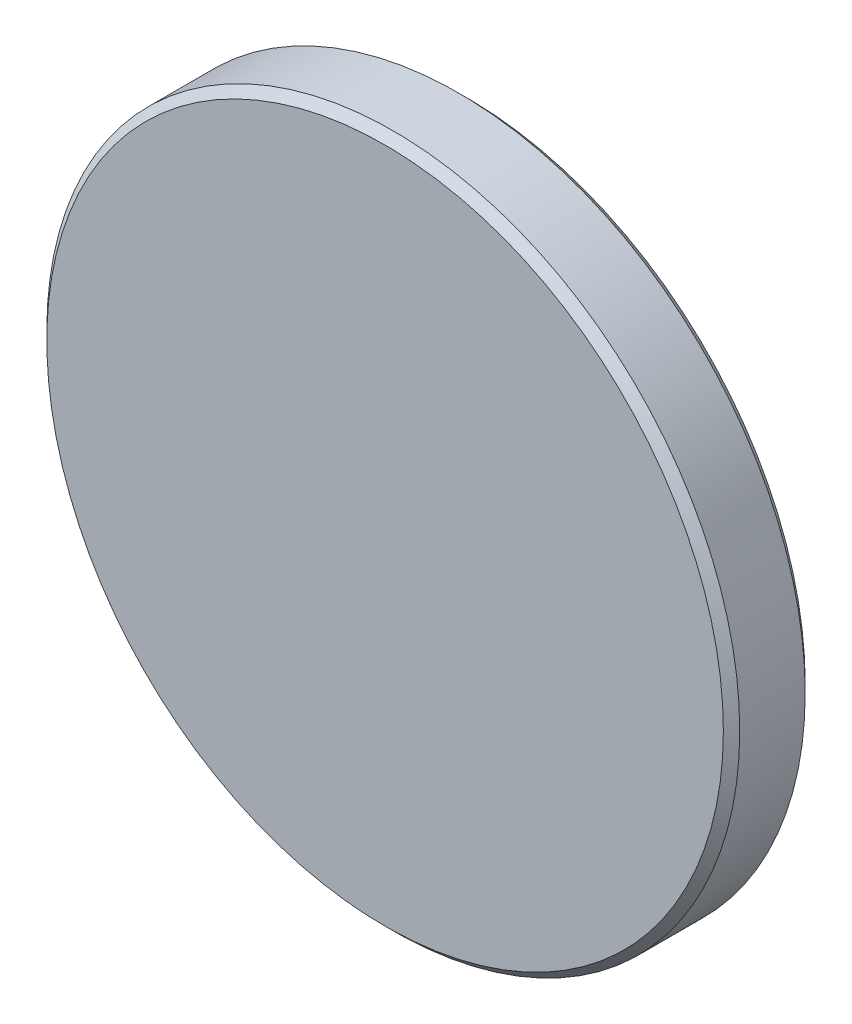
ISO-10303-21;
HEADER;
FILE_DESCRIPTION(('STEP AP214'),'2;1');
FILE_NAME('part.step','',(''),(''),'','','');
FILE_SCHEMA(('AUTOMOTIVE_DESIGN { 1 0 10303 214 1 1 1 1 }'));
ENDSEC;
DATA;
#1=APPLICATION_CONTEXT('core data for automotive mechanical design processes');
#2=APPLICATION_PROTOCOL_DEFINITION('international standard','automotive_design',2000,#1);
#3=PRODUCT_CONTEXT('',#1,'mechanical');
#4=PRODUCT('Part','Part','',(#3));
#5=PRODUCT_RELATED_PRODUCT_CATEGORY('part','',(#4));
#6=PRODUCT_DEFINITION_FORMATION('','',#4);
#7=PRODUCT_DEFINITION_CONTEXT('part definition',#1,'design');
#8=PRODUCT_DEFINITION('design','',#6,#7);
#9=PRODUCT_DEFINITION_SHAPE('','',#8);
#10=(LENGTH_UNIT() NAMED_UNIT(*) SI_UNIT(.MILLI.,.METRE.));
#11=(NAMED_UNIT(*) PLANE_ANGLE_UNIT() SI_UNIT($,.RADIAN.));
#12=(NAMED_UNIT(*) SI_UNIT($,.STERADIAN.) SOLID_ANGLE_UNIT());
#13=UNCERTAINTY_MEASURE_WITH_UNIT(LENGTH_MEASURE(1.E-05),#10,'distance_accuracy_value','');
#14=(GEOMETRIC_REPRESENTATION_CONTEXT(3) GLOBAL_UNCERTAINTY_ASSIGNED_CONTEXT((#13)) GLOBAL_UNIT_ASSIGNED_CONTEXT((#10,
#11,#12)) REPRESENTATION_CONTEXT('',''));
#15=CARTESIAN_POINT('',(0.,0.,0.));
#16=DIRECTION('',(0.,0.,1.));
#17=DIRECTION('',(1.,0.,0.));
#18=AXIS2_PLACEMENT_3D('',#15,#16,#17);
#19=CARTESIAN_POINT('',(0.,0.,3.));
#20=DIRECTION('',(0.,0.,-1.));
#21=DIRECTION('',(-1.,0.,0.));
#22=AXIS2_PLACEMENT_3D('',#19,#20,#21);
#23=CYLINDRICAL_SURFACE('',#22,12.7);
#24=CARTESIAN_POINT('',(0.,0.,0.299999999999998));
#25=DIRECTION('',(0.,0.,1.));
#26=DIRECTION('',(1.,0.,0.));
#27=AXIS2_PLACEMENT_3D('',#24,#25,#26);
#28=CIRCLE('',#27,12.7);
#29=CARTESIAN_POINT('',(12.7,0.,0.299999999999998));
#30=VERTEX_POINT('',#29);
#31=EDGE_CURVE('E44',#30,#30,#28,.T.);
#32=ORIENTED_EDGE('',*,*,#31,.T.);
#33=EDGE_LOOP('',(#32));
#34=FACE_BOUND('',#33,.T.);
#35=CARTESIAN_POINT('',(0.,0.,2.69999999999999));
#36=DIRECTION('',(0.,0.,1.));
#37=DIRECTION('',(1.,0.,0.));
#38=AXIS2_PLACEMENT_3D('',#35,#36,#37);
#39=CIRCLE('',#38,12.7);
#40=CARTESIAN_POINT('',(12.7,0.,2.69999999999999));
#41=VERTEX_POINT('',#40);
#42=EDGE_CURVE('E48',#41,#41,#39,.F.);
#43=ORIENTED_EDGE('',*,*,#42,.T.);
#44=EDGE_LOOP('',(#43));
#45=FACE_BOUND('',#44,.T.);
#46=ADVANCED_FACE('F33',(#34,#45),#23,.T.);
#47=CARTESIAN_POINT('',(0.,0.,3.));
#48=DIRECTION('',(0.,0.,1.));
#49=DIRECTION('',(1.,0.,0.));
#50=AXIS2_PLACEMENT_3D('',#47,#48,#49);
#51=PLANE('',#50);
#52=CARTESIAN_POINT('',(0.,0.,3.));
#53=DIRECTION('',(0.,0.,1.));
#54=DIRECTION('',(1.,0.,0.));
#55=AXIS2_PLACEMENT_3D('',#52,#53,#54);
#56=CIRCLE('',#55,12.4);
#57=CARTESIAN_POINT('',(12.4,0.,3.));
#58=VERTEX_POINT('',#57);
#59=EDGE_CURVE('E10',#58,#58,#56,.T.);
#60=ORIENTED_EDGE('',*,*,#59,.T.);
#61=EDGE_LOOP('',(#60));
#62=FACE_BOUND('',#61,.T.);
#63=ADVANCED_FACE('F64',(#62),#51,.T.);
#64=CARTESIAN_POINT('',(0.,0.,0.));
#65=DIRECTION('',(0.,0.,1.));
#66=DIRECTION('',(1.,0.,0.));
#67=AXIS2_PLACEMENT_3D('',#64,#65,#66);
#68=PLANE('',#67);
#69=CARTESIAN_POINT('',(0.,0.,0.));
#70=DIRECTION('',(0.,0.,1.));
#71=DIRECTION('',(1.,0.,0.));
#72=AXIS2_PLACEMENT_3D('',#69,#70,#71);
#73=CIRCLE('',#72,12.4);
#74=CARTESIAN_POINT('',(12.4,0.,0.));
#75=VERTEX_POINT('',#74);
#76=EDGE_CURVE('E40',#75,#75,#73,.F.);
#77=ORIENTED_EDGE('',*,*,#76,.T.);
#78=EDGE_LOOP('',(#77));
#79=FACE_BOUND('',#78,.T.);
#80=ADVANCED_FACE('F61',(#79),#68,.F.);
#81=CARTESIAN_POINT('',(0.,0.,0.299999999999998));
#82=DIRECTION('',(0.,0.,1.));
#83=DIRECTION('',(1.,0.,0.));
#84=AXIS2_PLACEMENT_3D('',#81,#82,#83);
#85=CONICAL_SURFACE('',#84,12.7,0.785398163397451);
#86=ORIENTED_EDGE('',*,*,#76,.F.);
#87=EDGE_LOOP('',(#86));
#88=FACE_BOUND('',#87,.T.);
#89=ORIENTED_EDGE('',*,*,#31,.F.);
#90=EDGE_LOOP('',(#89));
#91=FACE_BOUND('',#90,.T.);
#92=ADVANCED_FACE('F57',(#88,#91),#85,.T.);
#93=CARTESIAN_POINT('',(0.,0.,3.));
#94=DIRECTION('',(0.,0.,-1.));
#95=DIRECTION('',(-1.,0.,0.));
#96=AXIS2_PLACEMENT_3D('',#93,#94,#95);
#97=CONICAL_SURFACE('',#96,12.4,0.785398163397451);
#98=ORIENTED_EDGE('',*,*,#42,.F.);
#99=EDGE_LOOP('',(#98));
#100=FACE_BOUND('',#99,.T.);
#101=ORIENTED_EDGE('',*,*,#59,.F.);
#102=EDGE_LOOP('',(#101));
#103=FACE_BOUND('',#102,.T.);
#104=ADVANCED_FACE('F35',(#100,#103),#97,.T.);
#105=CLOSED_SHELL('',(#46,#63,#80,#92,#104));
#106=MANIFOLD_SOLID_BREP('B2',#105);
#107=ADVANCED_BREP_SHAPE_REPRESENTATION('',(#18,#106),#14);
#108=SHAPE_DEFINITION_REPRESENTATION(#9,#107);
ENDSEC;
END-ISO-10303-21;
